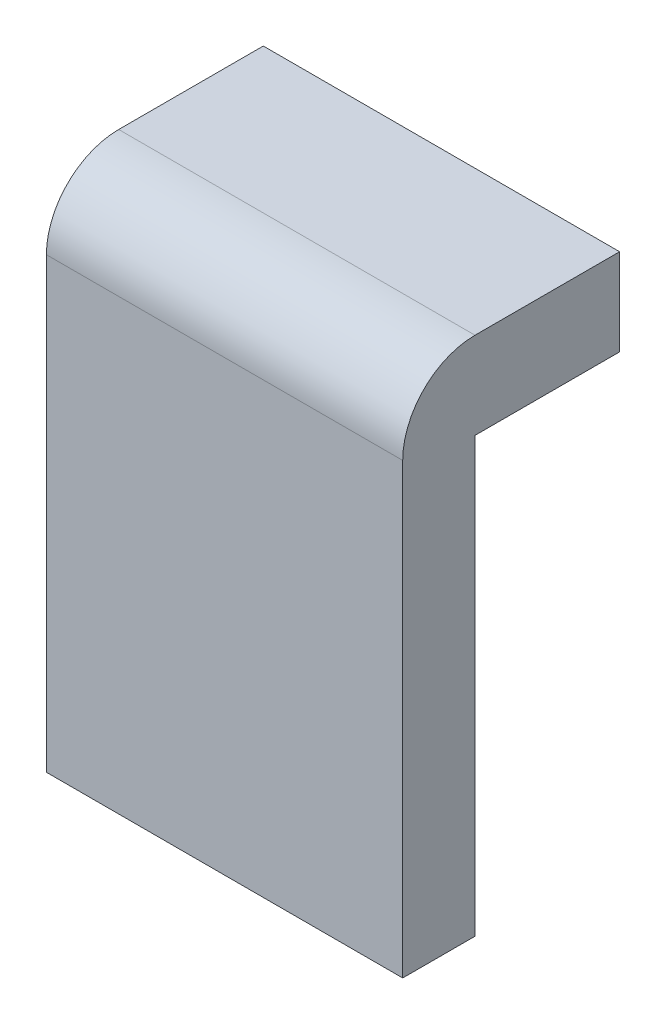
ISO-10303-21;
HEADER;
FILE_DESCRIPTION(('STEP AP214'),'2;1');
FILE_NAME('part.step','',(''),(''),'','','');
FILE_SCHEMA(('AUTOMOTIVE_DESIGN { 1 0 10303 214 1 1 1 1 }'));
ENDSEC;
DATA;
#1=APPLICATION_CONTEXT('core data for automotive mechanical design processes');
#2=APPLICATION_PROTOCOL_DEFINITION('international standard','automotive_design',2000,#1);
#3=PRODUCT_CONTEXT('',#1,'mechanical');
#4=PRODUCT('Part','Part','',(#3));
#5=PRODUCT_RELATED_PRODUCT_CATEGORY('part','',(#4));
#6=PRODUCT_DEFINITION_FORMATION('','',#4);
#7=PRODUCT_DEFINITION_CONTEXT('part definition',#1,'design');
#8=PRODUCT_DEFINITION('design','',#6,#7);
#9=PRODUCT_DEFINITION_SHAPE('','',#8);
#10=(LENGTH_UNIT() NAMED_UNIT(*) SI_UNIT(.MILLI.,.METRE.));
#11=(NAMED_UNIT(*) PLANE_ANGLE_UNIT() SI_UNIT($,.RADIAN.));
#12=(NAMED_UNIT(*) SI_UNIT($,.STERADIAN.) SOLID_ANGLE_UNIT());
#13=UNCERTAINTY_MEASURE_WITH_UNIT(LENGTH_MEASURE(1.E-05),#10,'distance_accuracy_value','');
#14=(GEOMETRIC_REPRESENTATION_CONTEXT(3) GLOBAL_UNCERTAINTY_ASSIGNED_CONTEXT((#13)) GLOBAL_UNIT_ASSIGNED_CONTEXT((#10,
#11,#12)) REPRESENTATION_CONTEXT('',''));
#15=CARTESIAN_POINT('',(0.,0.,0.));
#16=DIRECTION('',(0.,0.,1.));
#17=DIRECTION('',(1.,0.,0.));
#18=AXIS2_PLACEMENT_3D('',#15,#16,#17);
#19=CARTESIAN_POINT('',(-8.34906661620967,8.30000000000001,12.2546737770755));
#20=DIRECTION('',(0.,0.,1.));
#21=DIRECTION('',(0.,-1.,0.));
#22=AXIS2_PLACEMENT_3D('',#19,#20,#21);
#23=PLANE('',#22);
#24=DIRECTION('',(1.,0.,0.));
#25=VECTOR('',#24,1.);
#26=CARTESIAN_POINT('',(-15.8147962412963,6.80000000000003,12.2546737770755));
#27=LINE('',#26,#25);
#28=CARTESIAN_POINT('',(-0.8725217929937,6.80000000000003,12.2546737770755));
#29=VERTEX_POINT('',#28);
#30=CARTESIAN_POINT('',(0.359628963447023,6.80000000000003,12.2546737770755));
#31=VERTEX_POINT('',#30);
#32=EDGE_CURVE('E113',#29,#31,#27,.T.);
#33=ORIENTED_EDGE('',*,*,#32,.F.);
#34=DIRECTION('',(0.,1.,0.));
#35=VECTOR('',#34,1.);
#36=CARTESIAN_POINT('',(-0.8725217929937,5.35753839337147,12.2546737770755));
#37=LINE('',#36,#35);
#38=CARTESIAN_POINT('',(-0.8725217929937,8.30000000000001,12.2546737770755));
#39=VERTEX_POINT('',#38);
#40=EDGE_CURVE('E148',#39,#29,#37,.F.);
#41=ORIENTED_EDGE('',*,*,#40,.F.);
#42=DIRECTION('',(1.,0.,0.));
#43=VECTOR('',#42,1.);
#44=CARTESIAN_POINT('',(-8.34906661620967,8.30000000000001,12.2546737770755));
#45=LINE('',#44,#43);
#46=CARTESIAN_POINT('',(0.359628963447024,8.30000000000001,12.2546737770755));
#47=VERTEX_POINT('',#46);
#48=EDGE_CURVE('E133',#39,#47,#45,.T.);
#49=ORIENTED_EDGE('',*,*,#48,.T.);
#50=DIRECTION('',(0.,1.,0.));
#51=VECTOR('',#50,1.);
#52=CARTESIAN_POINT('',(0.359628963447024,5.35753839337147,12.2546737770755));
#53=LINE('',#52,#51);
#54=EDGE_CURVE('E105',#31,#47,#53,.T.);
#55=ORIENTED_EDGE('',*,*,#54,.F.);
#56=EDGE_LOOP('',(#33,#41,#49,#55));
#57=FACE_BOUND('',#56,.T.);
#58=ADVANCED_FACE('F17',(#57),#23,.F.);
#59=CARTESIAN_POINT('',(-8.34906661620967,8.30000000000001,11.7546737770755));
#60=DIRECTION('',(0.,1.,0.));
#61=DIRECTION('',(0.,0.,1.));
#62=AXIS2_PLACEMENT_3D('',#59,#60,#61);
#63=PLANE('',#62);
#64=ORIENTED_EDGE('',*,*,#48,.F.);
#65=DIRECTION('',(0.,0.,1.));
#66=VECTOR('',#65,1.);
#67=CARTESIAN_POINT('',(-0.8725217929937,8.30000000000001,12.5046737770755));
#68=LINE('',#67,#66);
#69=CARTESIAN_POINT('',(-0.8725217929937,8.30000000000001,11.7546737770755));
#70=VERTEX_POINT('',#69);
#71=EDGE_CURVE('E153',#70,#39,#68,.T.);
#72=ORIENTED_EDGE('',*,*,#71,.F.);
#73=DIRECTION('',(1.,0.,0.));
#74=VECTOR('',#73,1.);
#75=CARTESIAN_POINT('',(-0.8725217929937,8.30000000000001,11.7546737770755));
#76=LINE('',#75,#74);
#77=CARTESIAN_POINT('',(0.359628963447024,8.30000000000001,11.7546737770755));
#78=VERTEX_POINT('',#77);
#79=EDGE_CURVE('E124',#78,#70,#76,.F.);
#80=ORIENTED_EDGE('',*,*,#79,.F.);
#81=DIRECTION('',(0.,0.,-1.));
#82=VECTOR('',#81,1.);
#83=CARTESIAN_POINT('',(0.359628963447024,8.30000000000001,12.5046737770755));
#84=LINE('',#83,#82);
#85=EDGE_CURVE('E129',#47,#78,#84,.T.);
#86=ORIENTED_EDGE('',*,*,#85,.F.);
#87=EDGE_LOOP('',(#64,#72,#80,#86));
#88=FACE_BOUND('',#87,.T.);
#89=ADVANCED_FACE('F175',(#88),#63,.F.);
#90=CARTESIAN_POINT('',(-0.8725217929937,5.35753839337146,11.7546737770755));
#91=DIRECTION('',(0.,0.,-1.));
#92=DIRECTION('',(0.,1.,0.));
#93=AXIS2_PLACEMENT_3D('',#90,#91,#92);
#94=PLANE('',#93);
#95=ORIENTED_EDGE('',*,*,#79,.T.);
#96=DIRECTION('',(0.,1.,0.));
#97=VECTOR('',#96,1.);
#98=CARTESIAN_POINT('',(-0.8725217929937,5.35753839337147,11.7546737770755));
#99=LINE('',#98,#97);
#100=CARTESIAN_POINT('',(-0.8725217929937,8.6,11.7546737770755));
#101=VERTEX_POINT('',#100);
#102=EDGE_CURVE('E119',#101,#70,#99,.F.);
#103=ORIENTED_EDGE('',*,*,#102,.F.);
#104=DIRECTION('',(1.,0.,0.));
#105=VECTOR('',#104,1.);
#106=CARTESIAN_POINT('',(-8.34906661620967,8.6,11.7546737770755));
#107=LINE('',#106,#105);
#108=CARTESIAN_POINT('',(0.359628963447024,8.6,11.7546737770755));
#109=VERTEX_POINT('',#108);
#110=EDGE_CURVE('E122',#101,#109,#107,.T.);
#111=ORIENTED_EDGE('',*,*,#110,.T.);
#112=DIRECTION('',(0.,1.,0.));
#113=VECTOR('',#112,1.);
#114=CARTESIAN_POINT('',(0.359628963447024,5.35753839337147,11.7546737770755));
#115=LINE('',#114,#113);
#116=EDGE_CURVE('E97',#78,#109,#115,.T.);
#117=ORIENTED_EDGE('',*,*,#116,.F.);
#118=EDGE_LOOP('',(#95,#103,#111,#117));
#119=FACE_BOUND('',#118,.T.);
#120=ADVANCED_FACE('F172',(#119),#94,.T.);
#121=CARTESIAN_POINT('',(-8.34906661620967,8.6,11.7546737770755));
#122=DIRECTION('',(0.,-1.,0.));
#123=DIRECTION('',(0.,0.,-1.));
#124=AXIS2_PLACEMENT_3D('',#121,#122,#123);
#125=PLANE('',#124);
#126=ORIENTED_EDGE('',*,*,#110,.F.);
#127=DIRECTION('',(0.,0.,1.));
#128=VECTOR('',#127,1.);
#129=CARTESIAN_POINT('',(-0.8725217929937,8.6,12.5046737770755));
#130=LINE('',#129,#128);
#131=CARTESIAN_POINT('',(-0.8725217929937,8.6,12.2546737770755));
#132=VERTEX_POINT('',#131);
#133=EDGE_CURVE('E83',#132,#101,#130,.F.);
#134=ORIENTED_EDGE('',*,*,#133,.F.);
#135=DIRECTION('',(1.,0.,0.));
#136=VECTOR('',#135,1.);
#137=CARTESIAN_POINT('',(-8.34906661620967,8.6,12.2546737770755));
#138=LINE('',#137,#136);
#139=CARTESIAN_POINT('',(0.359628963447021,8.6,12.2546737770755));
#140=VERTEX_POINT('',#139);
#141=EDGE_CURVE('E79',#140,#132,#138,.F.);
#142=ORIENTED_EDGE('',*,*,#141,.F.);
#143=DIRECTION('',(0.,0.,-1.));
#144=VECTOR('',#143,1.);
#145=CARTESIAN_POINT('',(0.359628963447024,8.6,12.5046737770755));
#146=LINE('',#145,#144);
#147=EDGE_CURVE('E94',#109,#140,#146,.F.);
#148=ORIENTED_EDGE('',*,*,#147,.F.);
#149=EDGE_LOOP('',(#126,#134,#142,#148));
#150=FACE_BOUND('',#149,.T.);
#151=ADVANCED_FACE('F168',(#150),#125,.F.);
#152=CARTESIAN_POINT('',(-8.34906661620967,8.35,12.2546737770755));
#153=DIRECTION('',(1.,0.,0.));
#154=DIRECTION('',(0.,0.,-1.));
#155=AXIS2_PLACEMENT_3D('',#152,#153,#154);
#156=CYLINDRICAL_SURFACE('',#155,0.249999999999995);
#157=CARTESIAN_POINT('',(-0.872521792993701,8.35,12.2546737770755));
#158=DIRECTION('',(1.,0.,0.));
#159=DIRECTION('',(0.,0.,-1.));
#160=AXIS2_PLACEMENT_3D('',#157,#158,#159);
#161=CIRCLE('',#160,0.249999999999995);
#162=CARTESIAN_POINT('',(-0.872521792993701,8.35,12.5046737770755));
#163=VERTEX_POINT('',#162);
#164=EDGE_CURVE('E20',#163,#132,#161,.F.);
#165=ORIENTED_EDGE('',*,*,#164,.F.);
#166=DIRECTION('',(1.,0.,0.));
#167=VECTOR('',#166,1.);
#168=CARTESIAN_POINT('',(-0.8725217929937,8.35,12.5046737770755));
#169=LINE('',#168,#167);
#170=CARTESIAN_POINT('',(0.359628963447023,8.35,12.5046737770755));
#171=VERTEX_POINT('',#170);
#172=EDGE_CURVE('E77',#171,#163,#169,.F.);
#173=ORIENTED_EDGE('',*,*,#172,.F.);
#174=CARTESIAN_POINT('',(0.359628963447021,8.35,12.2546737770755));
#175=DIRECTION('',(1.,0.,0.));
#176=DIRECTION('',(0.,0.,-1.));
#177=AXIS2_PLACEMENT_3D('',#174,#175,#176);
#178=CIRCLE('',#177,0.249999999999995);
#179=EDGE_CURVE('E106',#140,#171,#178,.T.);
#180=ORIENTED_EDGE('',*,*,#179,.F.);
#181=ORIENTED_EDGE('',*,*,#141,.T.);
#182=EDGE_LOOP('',(#165,#173,#180,#181));
#183=FACE_BOUND('',#182,.T.);
#184=ADVANCED_FACE('F74',(#183),#156,.T.);
#185=CARTESIAN_POINT('',(-0.8725217929937,5.35753839337147,12.5046737770755));
#186=DIRECTION('',(-1.,0.,0.));
#187=DIRECTION('',(0.,0.,1.));
#188=AXIS2_PLACEMENT_3D('',#185,#186,#187);
#189=PLANE('',#188);
#190=DIRECTION('',(0.,0.,-1.));
#191=VECTOR('',#190,1.);
#192=CARTESIAN_POINT('',(-0.8725217929937,6.80000000000003,12.5046737770755));
#193=LINE('',#192,#191);
#194=CARTESIAN_POINT('',(-0.872521792993701,6.80000000000003,12.5046737770755));
#195=VERTEX_POINT('',#194);
#196=EDGE_CURVE('E89',#195,#29,#193,.T.);
#197=ORIENTED_EDGE('',*,*,#196,.F.);
#198=DIRECTION('',(0.,-1.,0.));
#199=VECTOR('',#198,1.);
#200=CARTESIAN_POINT('',(-0.872521792993701,5.35753839337147,12.5046737770755));
#201=LINE('',#200,#199);
#202=EDGE_CURVE('E85',#163,#195,#201,.T.);
#203=ORIENTED_EDGE('',*,*,#202,.F.);
#204=ORIENTED_EDGE('',*,*,#164,.T.);
#205=ORIENTED_EDGE('',*,*,#133,.T.);
#206=ORIENTED_EDGE('',*,*,#102,.T.);
#207=ORIENTED_EDGE('',*,*,#71,.T.);
#208=ORIENTED_EDGE('',*,*,#40,.T.);
#209=EDGE_LOOP('',(#197,#203,#204,#205,#206,#207,#208));
#210=FACE_BOUND('',#209,.T.);
#211=ADVANCED_FACE('F86',(#210),#189,.T.);
#212=CARTESIAN_POINT('',(-15.8147962412963,6.80000000000003,12.5046737770755));
#213=DIRECTION('',(0.,-1.,0.));
#214=DIRECTION('',(0.,0.,-1.));
#215=AXIS2_PLACEMENT_3D('',#212,#213,#214);
#216=PLANE('',#215);
#217=DIRECTION('',(1.,0.,0.));
#218=VECTOR('',#217,1.);
#219=CARTESIAN_POINT('',(-0.8725217929937,6.80000000000003,12.5046737770755));
#220=LINE('',#219,#218);
#221=CARTESIAN_POINT('',(0.359628963447024,6.80000000000003,12.5046737770755));
#222=VERTEX_POINT('',#221);
#223=EDGE_CURVE('E26',#195,#222,#220,.T.);
#224=ORIENTED_EDGE('',*,*,#223,.F.);
#225=ORIENTED_EDGE('',*,*,#196,.T.);
#226=ORIENTED_EDGE('',*,*,#32,.T.);
#227=DIRECTION('',(0.,0.,-1.));
#228=VECTOR('',#227,1.);
#229=CARTESIAN_POINT('',(0.359628963447024,6.80000000000003,12.5046737770755));
#230=LINE('',#229,#228);
#231=EDGE_CURVE('E35',#222,#31,#230,.T.);
#232=ORIENTED_EDGE('',*,*,#231,.F.);
#233=EDGE_LOOP('',(#224,#225,#226,#232));
#234=FACE_BOUND('',#233,.T.);
#235=ADVANCED_FACE('F179',(#234),#216,.T.);
#236=CARTESIAN_POINT('',(0.359628963447024,5.35753839337147,12.5046737770755));
#237=DIRECTION('',(1.,0.,0.));
#238=DIRECTION('',(0.,0.,-1.));
#239=AXIS2_PLACEMENT_3D('',#236,#237,#238);
#240=PLANE('',#239);
#241=ORIENTED_EDGE('',*,*,#116,.T.);
#242=ORIENTED_EDGE('',*,*,#147,.T.);
#243=ORIENTED_EDGE('',*,*,#179,.T.);
#244=DIRECTION('',(0.,-1.,0.));
#245=VECTOR('',#244,1.);
#246=CARTESIAN_POINT('',(0.359628963447024,5.35753839337147,12.5046737770755));
#247=LINE('',#246,#245);
#248=EDGE_CURVE('E11',#222,#171,#247,.F.);
#249=ORIENTED_EDGE('',*,*,#248,.F.);
#250=ORIENTED_EDGE('',*,*,#231,.T.);
#251=ORIENTED_EDGE('',*,*,#54,.T.);
#252=ORIENTED_EDGE('',*,*,#85,.T.);
#253=EDGE_LOOP('',(#241,#242,#243,#249,#250,#251,#252));
#254=FACE_BOUND('',#253,.T.);
#255=ADVANCED_FACE('F164',(#254),#240,.T.);
#256=CARTESIAN_POINT('',(-0.8725217929937,5.35753839337147,12.5046737770755));
#257=DIRECTION('',(0.,0.,1.));
#258=DIRECTION('',(0.,-1.,0.));
#259=AXIS2_PLACEMENT_3D('',#256,#257,#258);
#260=PLANE('',#259);
#261=ORIENTED_EDGE('',*,*,#223,.T.);
#262=ORIENTED_EDGE('',*,*,#248,.T.);
#263=ORIENTED_EDGE('',*,*,#172,.T.);
#264=ORIENTED_EDGE('',*,*,#202,.T.);
#265=EDGE_LOOP('',(#261,#262,#263,#264));
#266=FACE_BOUND('',#265,.T.);
#267=ADVANCED_FACE('F93',(#266),#260,.T.);
#268=CLOSED_SHELL('',(#58,#89,#120,#151,#184,#211,#235,#255,#267));
#269=MANIFOLD_SOLID_BREP('B1',#268);
#270=ADVANCED_BREP_SHAPE_REPRESENTATION('',(#18,#269),#14);
#271=SHAPE_DEFINITION_REPRESENTATION(#9,#270);
ENDSEC;
END-ISO-10303-21;
